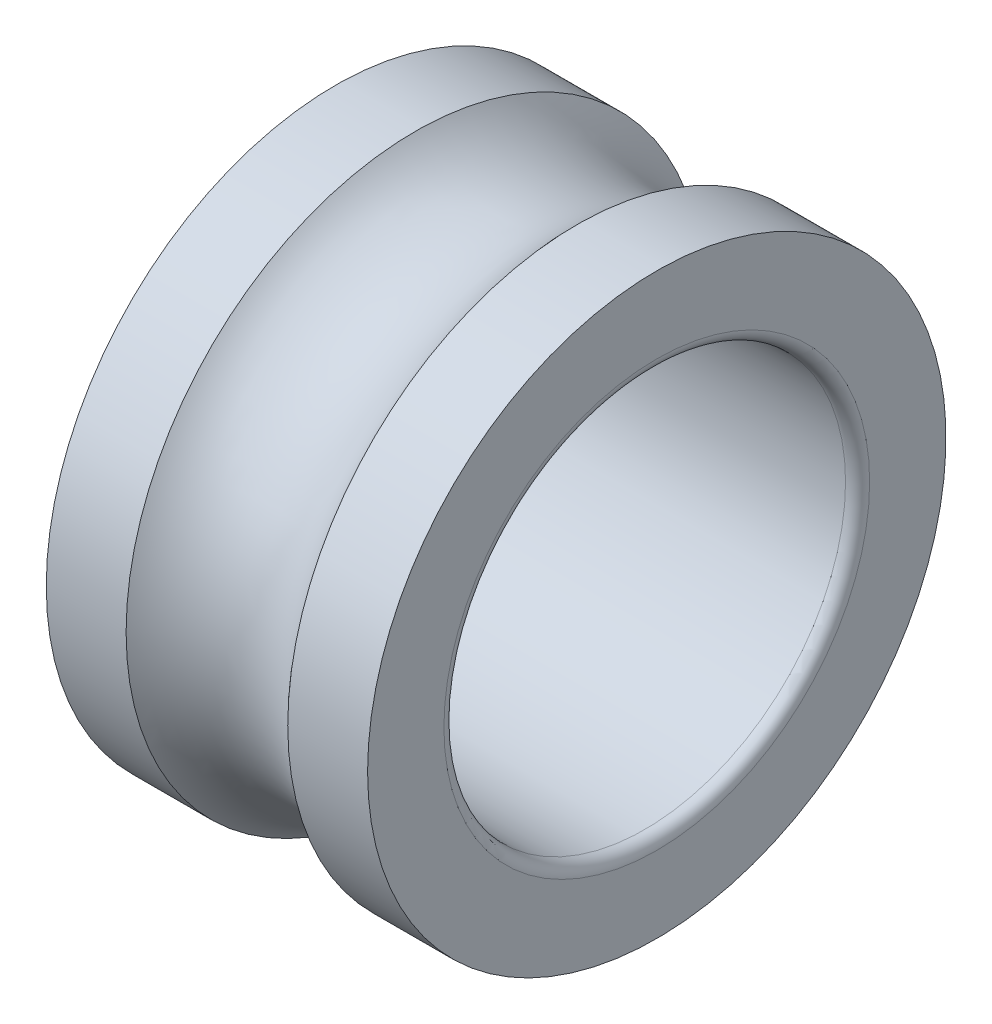
ISO-10303-21;
HEADER;
FILE_DESCRIPTION(('STEP AP214'),'2;1');
FILE_NAME('part.step','',(''),(''),'','','');
FILE_SCHEMA(('AUTOMOTIVE_DESIGN { 1 0 10303 214 1 1 1 1 }'));
ENDSEC;
DATA;
#1=APPLICATION_CONTEXT('core data for automotive mechanical design processes');
#2=APPLICATION_PROTOCOL_DEFINITION('international standard','automotive_design',2000,#1);
#3=PRODUCT_CONTEXT('',#1,'mechanical');
#4=PRODUCT('Part','Part','',(#3));
#5=PRODUCT_RELATED_PRODUCT_CATEGORY('part','',(#4));
#6=PRODUCT_DEFINITION_FORMATION('','',#4);
#7=PRODUCT_DEFINITION_CONTEXT('part definition',#1,'design');
#8=PRODUCT_DEFINITION('design','',#6,#7);
#9=PRODUCT_DEFINITION_SHAPE('','',#8);
#10=(LENGTH_UNIT() NAMED_UNIT(*) SI_UNIT(.MILLI.,.METRE.));
#11=(NAMED_UNIT(*) PLANE_ANGLE_UNIT() SI_UNIT($,.RADIAN.));
#12=(NAMED_UNIT(*) SI_UNIT($,.STERADIAN.) SOLID_ANGLE_UNIT());
#13=UNCERTAINTY_MEASURE_WITH_UNIT(LENGTH_MEASURE(1.E-05),#10,'distance_accuracy_value','');
#14=(GEOMETRIC_REPRESENTATION_CONTEXT(3) GLOBAL_UNCERTAINTY_ASSIGNED_CONTEXT((#13)) GLOBAL_UNIT_ASSIGNED_CONTEXT((#10,
#11,#12)) REPRESENTATION_CONTEXT('',''));
#15=CARTESIAN_POINT('',(0.,0.,0.));
#16=DIRECTION('',(0.,0.,1.));
#17=DIRECTION('',(1.,0.,0.));
#18=AXIS2_PLACEMENT_3D('',#15,#16,#17);
#19=CARTESIAN_POINT('',(0.,0.,0.));
#20=DIRECTION('',(-1.,0.,0.));
#21=DIRECTION('',(0.,0.,1.));
#22=AXIS2_PLACEMENT_3D('',#19,#20,#21);
#23=CYLINDRICAL_SURFACE('',#22,7.2);
#24=CARTESIAN_POINT('',(0.,0.,0.));
#25=DIRECTION('',(-1.,0.,0.));
#26=DIRECTION('',(0.,0.,1.));
#27=AXIS2_PLACEMENT_3D('',#24,#25,#26);
#28=CIRCLE('',#27,7.2);
#29=CARTESIAN_POINT('',(0.,0.,7.20000000000002));
#30=VERTEX_POINT('',#29);
#31=EDGE_CURVE('E10',#30,#30,#28,.T.);
#32=ORIENTED_EDGE('',*,*,#31,.F.);
#33=EDGE_LOOP('',(#32));
#34=FACE_BOUND('',#33,.T.);
#35=CARTESIAN_POINT('',(1.9878839220584,0.,0.));
#36=DIRECTION('',(-1.,0.,0.));
#37=DIRECTION('',(0.,0.,1.));
#38=AXIS2_PLACEMENT_3D('',#35,#36,#37);
#39=CIRCLE('',#38,7.2);
#40=CARTESIAN_POINT('',(1.9878839220584,0.,7.20000000000002));
#41=VERTEX_POINT('',#40);
#42=EDGE_CURVE('E42',#41,#41,#39,.T.);
#43=ORIENTED_EDGE('',*,*,#42,.T.);
#44=EDGE_LOOP('',(#43));
#45=FACE_BOUND('',#44,.T.);
#46=ADVANCED_FACE('F14',(#34,#45),#23,.T.);
#47=CARTESIAN_POINT('',(0.,7.2,0.));
#48=DIRECTION('',(1.,0.,0.));
#49=DIRECTION('',(0.,0.,-1.));
#50=AXIS2_PLACEMENT_3D('',#47,#48,#49);
#51=PLANE('',#50);
#52=CARTESIAN_POINT('',(0.,0.,0.));
#53=DIRECTION('',(-1.,0.,0.));
#54=DIRECTION('',(0.,0.,1.));
#55=AXIS2_PLACEMENT_3D('',#52,#53,#54);
#56=CIRCLE('',#55,5.3);
#57=CARTESIAN_POINT('',(0.,0.,5.30000000000001));
#58=VERTEX_POINT('',#57);
#59=EDGE_CURVE('E20',#58,#58,#56,.T.);
#60=ORIENTED_EDGE('',*,*,#59,.F.);
#61=EDGE_LOOP('',(#60));
#62=FACE_BOUND('',#61,.T.);
#63=ORIENTED_EDGE('',*,*,#31,.T.);
#64=EDGE_LOOP('',(#63));
#65=FACE_BOUND('',#64,.T.);
#66=ADVANCED_FACE('F60',(#62,#65),#51,.F.);
#67=CARTESIAN_POINT('',(0.300000000000002,0.,0.));
#68=DIRECTION('',(-1.,0.,0.));
#69=DIRECTION('',(0.,0.,1.));
#70=AXIS2_PLACEMENT_3D('',#67,#68,#69);
#71=TOROIDAL_SURFACE('',#70,5.3,0.3);
#72=CARTESIAN_POINT('',(0.300000000000002,0.,0.));
#73=DIRECTION('',(-1.,0.,0.));
#74=DIRECTION('',(0.,0.,1.));
#75=AXIS2_PLACEMENT_3D('',#72,#73,#74);
#76=CIRCLE('',#75,5.);
#77=CARTESIAN_POINT('',(0.300000000000002,0.,5.00000000000001));
#78=VERTEX_POINT('',#77);
#79=EDGE_CURVE('E24',#78,#78,#76,.T.);
#80=ORIENTED_EDGE('',*,*,#79,.F.);
#81=EDGE_LOOP('',(#80));
#82=FACE_BOUND('',#81,.T.);
#83=ORIENTED_EDGE('',*,*,#59,.T.);
#84=EDGE_LOOP('',(#83));
#85=FACE_BOUND('',#84,.T.);
#86=ADVANCED_FACE('F65',(#82,#85),#71,.T.);
#87=CARTESIAN_POINT('',(0.,0.,0.));
#88=DIRECTION('',(-1.,0.,0.));
#89=DIRECTION('',(0.,0.,1.));
#90=AXIS2_PLACEMENT_3D('',#87,#88,#89);
#91=CYLINDRICAL_SURFACE('',#90,5.);
#92=CARTESIAN_POINT('',(7.7,0.,0.));
#93=DIRECTION('',(-1.,0.,0.));
#94=DIRECTION('',(0.,0.,1.));
#95=AXIS2_PLACEMENT_3D('',#92,#93,#94);
#96=CIRCLE('',#95,5.);
#97=CARTESIAN_POINT('',(7.7,0.,5.00000000000001));
#98=VERTEX_POINT('',#97);
#99=EDGE_CURVE('E28',#98,#98,#96,.T.);
#100=ORIENTED_EDGE('',*,*,#99,.F.);
#101=EDGE_LOOP('',(#100));
#102=FACE_BOUND('',#101,.T.);
#103=ORIENTED_EDGE('',*,*,#79,.T.);
#104=EDGE_LOOP('',(#103));
#105=FACE_BOUND('',#104,.T.);
#106=ADVANCED_FACE('F70',(#102,#105),#91,.F.);
#107=CARTESIAN_POINT('',(7.7,0.,0.));
#108=DIRECTION('',(-1.,0.,0.));
#109=DIRECTION('',(0.,0.,1.));
#110=AXIS2_PLACEMENT_3D('',#107,#108,#109);
#111=TOROIDAL_SURFACE('',#110,5.3,0.3);
#112=CARTESIAN_POINT('',(8.,0.,0.));
#113=DIRECTION('',(-1.,0.,0.));
#114=DIRECTION('',(0.,0.,1.));
#115=AXIS2_PLACEMENT_3D('',#112,#113,#114);
#116=CIRCLE('',#115,5.3);
#117=CARTESIAN_POINT('',(8.,0.,5.30000000000001));
#118=VERTEX_POINT('',#117);
#119=EDGE_CURVE('E33',#118,#118,#116,.T.);
#120=ORIENTED_EDGE('',*,*,#119,.F.);
#121=EDGE_LOOP('',(#120));
#122=FACE_BOUND('',#121,.T.);
#123=ORIENTED_EDGE('',*,*,#99,.T.);
#124=EDGE_LOOP('',(#123));
#125=FACE_BOUND('',#124,.T.);
#126=ADVANCED_FACE('F76',(#122,#125),#111,.T.);
#127=CARTESIAN_POINT('',(8.,5.3,0.));
#128=DIRECTION('',(-1.,0.,0.));
#129=DIRECTION('',(0.,0.,1.));
#130=AXIS2_PLACEMENT_3D('',#127,#128,#129);
#131=PLANE('',#130);
#132=CARTESIAN_POINT('',(8.,0.,0.));
#133=DIRECTION('',(-1.,0.,0.));
#134=DIRECTION('',(0.,0.,1.));
#135=AXIS2_PLACEMENT_3D('',#132,#133,#134);
#136=CIRCLE('',#135,7.2);
#137=CARTESIAN_POINT('',(8.,0.,7.20000000000002));
#138=VERTEX_POINT('',#137);
#139=EDGE_CURVE('E36',#138,#138,#136,.T.);
#140=ORIENTED_EDGE('',*,*,#139,.F.);
#141=EDGE_LOOP('',(#140));
#142=FACE_BOUND('',#141,.T.);
#143=ORIENTED_EDGE('',*,*,#119,.T.);
#144=EDGE_LOOP('',(#143));
#145=FACE_BOUND('',#144,.T.);
#146=ADVANCED_FACE('F56',(#142,#145),#131,.F.);
#147=CARTESIAN_POINT('',(0.,0.,0.));
#148=DIRECTION('',(-1.,0.,0.));
#149=DIRECTION('',(0.,0.,1.));
#150=AXIS2_PLACEMENT_3D('',#147,#148,#149);
#151=CYLINDRICAL_SURFACE('',#150,7.2);
#152=CARTESIAN_POINT('',(6.01211607794161,0.,0.));
#153=DIRECTION('',(-1.,0.,0.));
#154=DIRECTION('',(0.,0.,1.));
#155=AXIS2_PLACEMENT_3D('',#152,#153,#154);
#156=CIRCLE('',#155,7.2);
#157=CARTESIAN_POINT('',(6.01211607794161,0.,7.20000000000002));
#158=VERTEX_POINT('',#157);
#159=EDGE_CURVE('E39',#158,#158,#156,.T.);
#160=ORIENTED_EDGE('',*,*,#159,.F.);
#161=EDGE_LOOP('',(#160));
#162=FACE_BOUND('',#161,.T.);
#163=ORIENTED_EDGE('',*,*,#139,.T.);
#164=EDGE_LOOP('',(#163));
#165=FACE_BOUND('',#164,.T.);
#166=ADVANCED_FACE('F49',(#162,#165),#151,.T.);
#167=CARTESIAN_POINT('',(4.,0.,0.));
#168=DIRECTION('',(-1.,0.,0.));
#169=DIRECTION('',(0.,0.,1.));
#170=AXIS2_PLACEMENT_3D('',#167,#168,#169);
#171=TOROIDAL_SURFACE('',#170,8.95,2.66666666666666);
#172=ORIENTED_EDGE('',*,*,#159,.T.);
#173=EDGE_LOOP('',(#172));
#174=FACE_BOUND('',#173,.T.);
#175=ORIENTED_EDGE('',*,*,#42,.F.);
#176=EDGE_LOOP('',(#175));
#177=FACE_BOUND('',#176,.T.);
#178=ADVANCED_FACE('F47',(#174,#177),#171,.F.);
#179=CLOSED_SHELL('',(#46,#66,#86,#106,#126,#146,#166,#178));
#180=MANIFOLD_SOLID_BREP('B1',#179);
#181=ADVANCED_BREP_SHAPE_REPRESENTATION('',(#18,#180),#14);
#182=SHAPE_DEFINITION_REPRESENTATION(#9,#181);
ENDSEC;
END-ISO-10303-21;
